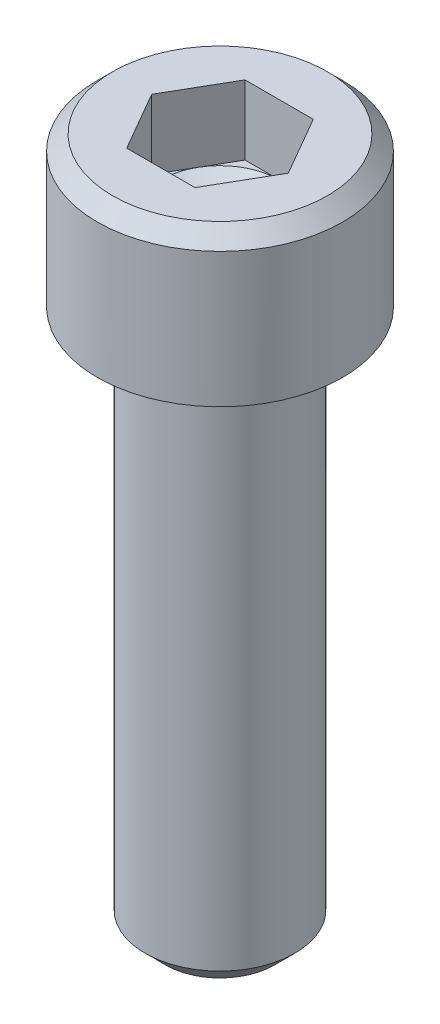
ISO-10303-21;
HEADER;
FILE_DESCRIPTION(('STEP AP214'),'2;1');
FILE_NAME('part.step','',(''),(''),'','','');
FILE_SCHEMA(('AUTOMOTIVE_DESIGN { 1 0 10303 214 1 1 1 1 }'));
ENDSEC;
DATA;
#1=APPLICATION_CONTEXT('core data for automotive mechanical design processes');
#2=APPLICATION_PROTOCOL_DEFINITION('international standard','automotive_design',2000,#1);
#3=PRODUCT_CONTEXT('',#1,'mechanical');
#4=PRODUCT('Part','Part','',(#3));
#5=PRODUCT_RELATED_PRODUCT_CATEGORY('part','',(#4));
#6=PRODUCT_DEFINITION_FORMATION('','',#4);
#7=PRODUCT_DEFINITION_CONTEXT('part definition',#1,'design');
#8=PRODUCT_DEFINITION('design','',#6,#7);
#9=PRODUCT_DEFINITION_SHAPE('','',#8);
#10=(LENGTH_UNIT() NAMED_UNIT(*) SI_UNIT(.MILLI.,.METRE.));
#11=(NAMED_UNIT(*) PLANE_ANGLE_UNIT() SI_UNIT($,.RADIAN.));
#12=(NAMED_UNIT(*) SI_UNIT($,.STERADIAN.) SOLID_ANGLE_UNIT());
#13=UNCERTAINTY_MEASURE_WITH_UNIT(LENGTH_MEASURE(1.E-05),#10,'distance_accuracy_value','');
#14=(GEOMETRIC_REPRESENTATION_CONTEXT(3) GLOBAL_UNCERTAINTY_ASSIGNED_CONTEXT((#13)) GLOBAL_UNIT_ASSIGNED_CONTEXT((#10,
#11,#12)) REPRESENTATION_CONTEXT('',''));
#15=CARTESIAN_POINT('',(0.,0.,0.));
#16=DIRECTION('',(0.,0.,1.));
#17=DIRECTION('',(1.,0.,0.));
#18=AXIS2_PLACEMENT_3D('',#15,#16,#17);
#19=CARTESIAN_POINT('',(0.,1.8796,0.));
#20=DIRECTION('',(0.,1.,0.));
#21=DIRECTION('',(0.,0.,1.));
#22=AXIS2_PLACEMENT_3D('',#19,#20,#21);
#23=PLANE('',#22);
#24=DIRECTION('',(0.5,0.,-0.866025403784439));
#25=VECTOR('',#24,1.);
#26=CARTESIAN_POINT('',(0.799225977639064,1.8796,1.38429999999992));
#27=LINE('',#26,#25);
#28=CARTESIAN_POINT('',(0.799225977639064,1.8796,1.38429999999992));
#29=VERTEX_POINT('',#28);
#30=CARTESIAN_POINT('',(1.19883896645866,1.87960000005181,0.692149999999922));
#31=VERTEX_POINT('',#30);
#32=EDGE_CURVE('E159',#29,#31,#27,.T.);
#33=ORIENTED_EDGE('',*,*,#32,.T.);
#34=CARTESIAN_POINT('',(0.,1.87960000005181,0.));
#35=DIRECTION('',(0.,-1.,0.));
#36=DIRECTION('',(1.,0.,0.));
#37=AXIS2_PLACEMENT_3D('',#34,#35,#36);
#38=CIRCLE('',#37,1.38429999998393);
#39=CARTESIAN_POINT('',(0.,1.87960000005181,1.38429999998393));
#40=VERTEX_POINT('',#39);
#41=EDGE_CURVE('E47',#31,#40,#38,.T.);
#42=ORIENTED_EDGE('',*,*,#41,.T.);
#43=DIRECTION('',(1.,0.,0.));
#44=VECTOR('',#43,1.);
#45=CARTESIAN_POINT('',(-0.799225977639255,1.8796,1.38429999999992));
#46=LINE('',#45,#44);
#47=EDGE_CURVE('E189',#40,#29,#46,.T.);
#48=ORIENTED_EDGE('',*,*,#47,.T.);
#49=EDGE_LOOP('',(#33,#42,#48));
#50=FACE_BOUND('',#49,.T.);
#51=ADVANCED_FACE('F32',(#50),#23,.T.);
#52=CARTESIAN_POINT('',(-0.799225977639255,1.8796,1.38429999999992));
#53=VERTEX_POINT('',#52);
#54=EDGE_CURVE('E279',#53,#40,#46,.T.);
#55=ORIENTED_EDGE('',*,*,#54,.T.);
#56=CARTESIAN_POINT('',(-1.19883896644491,1.87960000005181,0.692149999991913));
#57=VERTEX_POINT('',#56);
#58=EDGE_CURVE('E208',#40,#57,#38,.T.);
#59=ORIENTED_EDGE('',*,*,#58,.T.);
#60=DIRECTION('',(0.499999999999962,0.,0.866025403784461));
#61=VECTOR('',#60,1.);
#62=CARTESIAN_POINT('',(-1.59845195527835,1.8796,0.));
#63=LINE('',#62,#61);
#64=EDGE_CURVE('E168',#57,#53,#63,.T.);
#65=ORIENTED_EDGE('',*,*,#64,.T.);
#66=EDGE_LOOP('',(#55,#59,#65));
#67=FACE_BOUND('',#66,.T.);
#68=ADVANCED_FACE('F122',(#67),#23,.T.);
#69=CARTESIAN_POINT('',(-1.59845195527835,1.8796,0.));
#70=VERTEX_POINT('',#69);
#71=EDGE_CURVE('E169',#70,#57,#63,.T.);
#72=ORIENTED_EDGE('',*,*,#71,.T.);
#73=CARTESIAN_POINT('',(-1.19883896644488,1.87960000005181,-0.692149999991966));
#74=VERTEX_POINT('',#73);
#75=EDGE_CURVE('E282',#57,#74,#38,.T.);
#76=ORIENTED_EDGE('',*,*,#75,.T.);
#77=DIRECTION('',(-0.5,0.,0.866025403784439));
#78=VECTOR('',#77,1.);
#79=CARTESIAN_POINT('',(-0.799225977639255,1.8796,-1.38429999999987));
#80=LINE('',#79,#78);
#81=EDGE_CURVE('E164',#74,#70,#80,.T.);
#82=ORIENTED_EDGE('',*,*,#81,.T.);
#83=EDGE_LOOP('',(#72,#76,#82));
#84=FACE_BOUND('',#83,.T.);
#85=ADVANCED_FACE('F128',(#84),#23,.T.);
#86=CARTESIAN_POINT('',(-0.799225977639255,1.8796,-1.38429999999987));
#87=VERTEX_POINT('',#86);
#88=EDGE_CURVE('E165',#87,#74,#80,.T.);
#89=ORIENTED_EDGE('',*,*,#88,.T.);
#90=CARTESIAN_POINT('',(0.,1.87960000005181,-1.38429999998393));
#91=VERTEX_POINT('',#90);
#92=EDGE_CURVE('E285',#74,#91,#38,.T.);
#93=ORIENTED_EDGE('',*,*,#92,.T.);
#94=DIRECTION('',(-1.,0.,0.));
#95=VECTOR('',#94,1.);
#96=CARTESIAN_POINT('',(0.799225977638982,1.8796,-1.38429999999987));
#97=LINE('',#96,#95);
#98=EDGE_CURVE('E154',#91,#87,#97,.T.);
#99=ORIENTED_EDGE('',*,*,#98,.T.);
#100=EDGE_LOOP('',(#89,#93,#99));
#101=FACE_BOUND('',#100,.T.);
#102=ADVANCED_FACE('F143',(#101),#23,.T.);
#103=CARTESIAN_POINT('',(0.799225977638982,1.8796,-1.38429999999987));
#104=VERTEX_POINT('',#103);
#105=EDGE_CURVE('E157',#104,#91,#97,.T.);
#106=ORIENTED_EDGE('',*,*,#105,.T.);
#107=CARTESIAN_POINT('',(1.19883896644488,1.87960000005181,-0.692149999991966));
#108=VERTEX_POINT('',#107);
#109=EDGE_CURVE('E283',#91,#108,#38,.T.);
#110=ORIENTED_EDGE('',*,*,#109,.T.);
#111=DIRECTION('',(-0.5,0.,-0.866025403784439));
#112=VECTOR('',#111,1.);
#113=CARTESIAN_POINT('',(1.59845195527816,1.8796,0.));
#114=LINE('',#113,#112);
#115=EDGE_CURVE('E155',#108,#104,#114,.T.);
#116=ORIENTED_EDGE('',*,*,#115,.T.);
#117=EDGE_LOOP('',(#106,#110,#116));
#118=FACE_BOUND('',#117,.T.);
#119=ADVANCED_FACE('F134',(#118),#23,.T.);
#120=CARTESIAN_POINT('',(1.59845195527816,1.8796,0.));
#121=VERTEX_POINT('',#120);
#122=EDGE_CURVE('E147',#121,#108,#114,.T.);
#123=ORIENTED_EDGE('',*,*,#122,.T.);
#124=EDGE_CURVE('E148',#108,#31,#38,.T.);
#125=ORIENTED_EDGE('',*,*,#124,.T.);
#126=EDGE_CURVE('E150',#31,#121,#27,.T.);
#127=ORIENTED_EDGE('',*,*,#126,.T.);
#128=EDGE_LOOP('',(#123,#125,#127));
#129=FACE_BOUND('',#128,.T.);
#130=ADVANCED_FACE('F124',(#129),#23,.T.);
#131=CARTESIAN_POINT('',(0.,0.,0.));
#132=DIRECTION('',(0.,-1.,0.));
#133=DIRECTION('',(0.,0.,-1.));
#134=AXIS2_PLACEMENT_3D('',#131,#132,#133);
#135=PLANE('',#134);
#136=CARTESIAN_POINT('',(0.,0.,0.));
#137=DIRECTION('',(0.,-1.,0.));
#138=DIRECTION('',(0.,0.,-1.));
#139=AXIS2_PLACEMENT_3D('',#136,#137,#138);
#140=CIRCLE('',#139,2.0066);
#141=CARTESIAN_POINT('',(0.,0.,-2.0066));
#142=VERTEX_POINT('',#141);
#143=EDGE_CURVE('E11',#142,#142,#140,.F.);
#144=ORIENTED_EDGE('',*,*,#143,.T.);
#145=EDGE_LOOP('',(#144));
#146=FACE_BOUND('',#145,.T.);
#147=CARTESIAN_POINT('',(0.,0.,0.));
#148=DIRECTION('',(0.,-1.,0.));
#149=DIRECTION('',(0.,0.,-1.));
#150=AXIS2_PLACEMENT_3D('',#147,#148,#149);
#151=CIRCLE('',#150,2.8702);
#152=CARTESIAN_POINT('',(0.,0.,-2.8702));
#153=VERTEX_POINT('',#152);
#154=EDGE_CURVE('E192',#153,#153,#151,.T.);
#155=ORIENTED_EDGE('',*,*,#154,.T.);
#156=EDGE_LOOP('',(#155));
#157=FACE_BOUND('',#156,.T.);
#158=ADVANCED_FACE('F133',(#146,#157),#135,.T.);
#159=CARTESIAN_POINT('',(0.,3.5052,0.));
#160=DIRECTION('',(0.,-1.,0.));
#161=DIRECTION('',(0.,0.,-1.));
#162=AXIS2_PLACEMENT_3D('',#159,#160,#161);
#163=CYLINDRICAL_SURFACE('',#162,2.8702);
#164=CARTESIAN_POINT('',(0.,3.14959999996017,0.));
#165=DIRECTION('',(0.,1.,0.));
#166=DIRECTION('',(0.,0.,1.));
#167=AXIS2_PLACEMENT_3D('',#164,#165,#166);
#168=CIRCLE('',#167,2.8702);
#169=CARTESIAN_POINT('',(0.,3.14959999996017,2.8702));
#170=VERTEX_POINT('',#169);
#171=EDGE_CURVE('E211',#170,#170,#168,.F.);
#172=ORIENTED_EDGE('',*,*,#171,.T.);
#173=EDGE_LOOP('',(#172));
#174=FACE_BOUND('',#173,.T.);
#175=ORIENTED_EDGE('',*,*,#154,.F.);
#176=EDGE_LOOP('',(#175));
#177=FACE_BOUND('',#176,.T.);
#178=ADVANCED_FACE('F140',(#174,#177),#163,.T.);
#179=CARTESIAN_POINT('',(2.8702,3.5052,0.));
#180=DIRECTION('',(0.,1.,0.));
#181=DIRECTION('',(0.,0.,1.));
#182=AXIS2_PLACEMENT_3D('',#179,#180,#181);
#183=PLANE('',#182);
#184=CARTESIAN_POINT('',(0.,3.5052,0.));
#185=DIRECTION('',(0.,1.,0.));
#186=DIRECTION('',(0.,0.,1.));
#187=AXIS2_PLACEMENT_3D('',#184,#185,#186);
#188=CIRCLE('',#187,2.51459999996016);
#189=CARTESIAN_POINT('',(0.,3.5052,2.51459999996016));
#190=VERTEX_POINT('',#189);
#191=EDGE_CURVE('E214',#190,#190,#188,.T.);
#192=ORIENTED_EDGE('',*,*,#191,.T.);
#193=EDGE_LOOP('',(#192));
#194=FACE_BOUND('',#193,.T.);
#195=DIRECTION('',(1.,0.,0.));
#196=VECTOR('',#195,1.);
#197=CARTESIAN_POINT('',(-0.799225977639255,3.5052,1.38429999999992));
#198=LINE('',#197,#196);
#199=CARTESIAN_POINT('',(-0.799225977639255,3.5052,1.38429999999992));
#200=VERTEX_POINT('',#199);
#201=CARTESIAN_POINT('',(0.799225977639064,3.5052,1.38429999999992));
#202=VERTEX_POINT('',#201);
#203=EDGE_CURVE('E55',#200,#202,#198,.T.);
#204=ORIENTED_EDGE('',*,*,#203,.F.);
#205=DIRECTION('',(0.499999999999962,0.,0.866025403784461));
#206=VECTOR('',#205,1.);
#207=CARTESIAN_POINT('',(-1.59845195527835,3.5052,0.));
#208=LINE('',#207,#206);
#209=CARTESIAN_POINT('',(-1.59845195527835,3.5052,0.));
#210=VERTEX_POINT('',#209);
#211=EDGE_CURVE('E186',#210,#200,#208,.T.);
#212=ORIENTED_EDGE('',*,*,#211,.F.);
#213=DIRECTION('',(-0.5,0.,0.866025403784439));
#214=VECTOR('',#213,1.);
#215=CARTESIAN_POINT('',(-0.799225977639255,3.5052,-1.38429999999987));
#216=LINE('',#215,#214);
#217=CARTESIAN_POINT('',(-0.799225977639255,3.5052,-1.38429999999987));
#218=VERTEX_POINT('',#217);
#219=EDGE_CURVE('E183',#218,#210,#216,.T.);
#220=ORIENTED_EDGE('',*,*,#219,.F.);
#221=DIRECTION('',(-1.,0.,0.));
#222=VECTOR('',#221,1.);
#223=CARTESIAN_POINT('',(0.799225977638982,3.5052,-1.38429999999987));
#224=LINE('',#223,#222);
#225=CARTESIAN_POINT('',(0.799225977638982,3.5052,-1.38429999999987));
#226=VERTEX_POINT('',#225);
#227=EDGE_CURVE('E180',#226,#218,#224,.T.);
#228=ORIENTED_EDGE('',*,*,#227,.F.);
#229=DIRECTION('',(-0.5,0.,-0.866025403784439));
#230=VECTOR('',#229,1.);
#231=CARTESIAN_POINT('',(1.59845195527816,3.5052,0.));
#232=LINE('',#231,#230);
#233=CARTESIAN_POINT('',(1.59845195527816,3.5052,0.));
#234=VERTEX_POINT('',#233);
#235=EDGE_CURVE('E177',#234,#226,#232,.T.);
#236=ORIENTED_EDGE('',*,*,#235,.F.);
#237=DIRECTION('',(0.5,0.,-0.866025403784439));
#238=VECTOR('',#237,1.);
#239=CARTESIAN_POINT('',(0.799225977639064,3.5052,1.38429999999992));
#240=LINE('',#239,#238);
#241=EDGE_CURVE('E174',#202,#234,#240,.T.);
#242=ORIENTED_EDGE('',*,*,#241,.F.);
#243=EDGE_LOOP('',(#204,#212,#220,#228,#236,#242));
#244=FACE_BOUND('',#243,.T.);
#245=ADVANCED_FACE('F233',(#194,#244),#183,.T.);
#246=CARTESIAN_POINT('',(0.,-12.7,0.));
#247=DIRECTION('',(0.,1.,0.));
#248=DIRECTION('',(0.,0.,1.));
#249=AXIS2_PLACEMENT_3D('',#246,#247,#248);
#250=CYLINDRICAL_SURFACE('',#249,1.7526);
#251=CARTESIAN_POINT('',(0.,-0.254000000000001,0.));
#252=DIRECTION('',(0.,-1.,0.));
#253=DIRECTION('',(0.,0.,-1.));
#254=AXIS2_PLACEMENT_3D('',#251,#252,#253);
#255=CIRCLE('',#254,1.7526);
#256=CARTESIAN_POINT('',(0.,-0.254000000000001,-1.7526));
#257=VERTEX_POINT('',#256);
#258=EDGE_CURVE('E40',#257,#257,#255,.T.);
#259=ORIENTED_EDGE('',*,*,#258,.T.);
#260=EDGE_LOOP('',(#259));
#261=FACE_BOUND('',#260,.T.);
#262=CARTESIAN_POINT('',(0.,-12.2275599999848,0.));
#263=DIRECTION('',(0.,-1.,0.));
#264=DIRECTION('',(0.,0.,-1.));
#265=AXIS2_PLACEMENT_3D('',#262,#263,#264);
#266=CIRCLE('',#265,1.7526);
#267=CARTESIAN_POINT('',(0.,-12.2275599999848,-1.7526));
#268=VERTEX_POINT('',#267);
#269=EDGE_CURVE('E207',#268,#268,#266,.F.);
#270=ORIENTED_EDGE('',*,*,#269,.T.);
#271=EDGE_LOOP('',(#270));
#272=FACE_BOUND('',#271,.T.);
#273=ADVANCED_FACE('F219',(#261,#272),#250,.T.);
#274=CARTESIAN_POINT('',(0.,-12.7,0.));
#275=DIRECTION('',(0.,-1.,0.));
#276=DIRECTION('',(0.,0.,-1.));
#277=AXIS2_PLACEMENT_3D('',#274,#275,#276);
#278=PLANE('',#277);
#279=CARTESIAN_POINT('',(0.,-12.7,0.));
#280=DIRECTION('',(0.,-1.,0.));
#281=DIRECTION('',(0.,0.,-1.));
#282=AXIS2_PLACEMENT_3D('',#279,#280,#281);
#283=CIRCLE('',#282,1.28015999998476);
#284=CARTESIAN_POINT('',(0.,-12.7,-1.28015999998476));
#285=VERTEX_POINT('',#284);
#286=EDGE_CURVE('E204',#285,#285,#283,.T.);
#287=ORIENTED_EDGE('',*,*,#286,.T.);
#288=EDGE_LOOP('',(#287));
#289=FACE_BOUND('',#288,.T.);
#290=ADVANCED_FACE('F244',(#289),#278,.T.);
#291=CARTESIAN_POINT('',(-0.799225977639255,1.8796,1.38429999999992));
#292=DIRECTION('',(0.,0.,1.));
#293=DIRECTION('',(1.,0.,0.));
#294=AXIS2_PLACEMENT_3D('',#291,#292,#293);
#295=PLANE('',#294);
#296=ORIENTED_EDGE('',*,*,#203,.T.);
#297=DIRECTION('',(0.,1.,0.));
#298=VECTOR('',#297,1.);
#299=CARTESIAN_POINT('',(0.799225977639064,1.8796,1.38429999999992));
#300=LINE('',#299,#298);
#301=EDGE_CURVE('E172',#29,#202,#300,.T.);
#302=ORIENTED_EDGE('',*,*,#301,.F.);
#303=ORIENTED_EDGE('',*,*,#47,.F.);
#304=ORIENTED_EDGE('',*,*,#54,.F.);
#305=DIRECTION('',(0.,1.,0.));
#306=VECTOR('',#305,1.);
#307=CARTESIAN_POINT('',(-0.799225977639255,1.8796,1.38429999999992));
#308=LINE('',#307,#306);
#309=EDGE_CURVE('E190',#53,#200,#308,.T.);
#310=ORIENTED_EDGE('',*,*,#309,.T.);
#311=EDGE_LOOP('',(#296,#302,#303,#304,#310));
#312=FACE_BOUND('',#311,.T.);
#313=ADVANCED_FACE('F247',(#312),#295,.F.);
#314=CARTESIAN_POINT('',(-1.59845195527835,1.8796,0.));
#315=DIRECTION('',(-0.866025403784461,0.,0.499999999999962));
#316=DIRECTION('',(0.499999999999962,0.,0.866025403784461));
#317=AXIS2_PLACEMENT_3D('',#314,#315,#316);
#318=PLANE('',#317);
#319=ORIENTED_EDGE('',*,*,#211,.T.);
#320=ORIENTED_EDGE('',*,*,#309,.F.);
#321=ORIENTED_EDGE('',*,*,#64,.F.);
#322=ORIENTED_EDGE('',*,*,#71,.F.);
#323=DIRECTION('',(0.,1.,0.));
#324=VECTOR('',#323,1.);
#325=CARTESIAN_POINT('',(-1.59845195527835,1.8796,0.));
#326=LINE('',#325,#324);
#327=EDGE_CURVE('E193',#70,#210,#326,.T.);
#328=ORIENTED_EDGE('',*,*,#327,.T.);
#329=EDGE_LOOP('',(#319,#320,#321,#322,#328));
#330=FACE_BOUND('',#329,.T.);
#331=ADVANCED_FACE('F250',(#330),#318,.F.);
#332=CARTESIAN_POINT('',(-0.799225977639255,1.8796,-1.38429999999987));
#333=DIRECTION('',(-0.866025403784439,0.,-0.5));
#334=DIRECTION('',(-0.5,0.,0.866025403784439));
#335=AXIS2_PLACEMENT_3D('',#332,#333,#334);
#336=PLANE('',#335);
#337=ORIENTED_EDGE('',*,*,#219,.T.);
#338=ORIENTED_EDGE('',*,*,#327,.F.);
#339=ORIENTED_EDGE('',*,*,#81,.F.);
#340=ORIENTED_EDGE('',*,*,#88,.F.);
#341=DIRECTION('',(0.,1.,0.));
#342=VECTOR('',#341,1.);
#343=CARTESIAN_POINT('',(-0.799225977639255,1.8796,-1.38429999999987));
#344=LINE('',#343,#342);
#345=EDGE_CURVE('E195',#87,#218,#344,.T.);
#346=ORIENTED_EDGE('',*,*,#345,.T.);
#347=EDGE_LOOP('',(#337,#338,#339,#340,#346));
#348=FACE_BOUND('',#347,.T.);
#349=ADVANCED_FACE('F257',(#348),#336,.F.);
#350=CARTESIAN_POINT('',(0.799225977638982,1.8796,-1.38429999999987));
#351=DIRECTION('',(0.,0.,-1.));
#352=DIRECTION('',(-1.,0.,0.));
#353=AXIS2_PLACEMENT_3D('',#350,#351,#352);
#354=PLANE('',#353);
#355=ORIENTED_EDGE('',*,*,#227,.T.);
#356=ORIENTED_EDGE('',*,*,#345,.F.);
#357=ORIENTED_EDGE('',*,*,#98,.F.);
#358=ORIENTED_EDGE('',*,*,#105,.F.);
#359=DIRECTION('',(0.,1.,0.));
#360=VECTOR('',#359,1.);
#361=CARTESIAN_POINT('',(0.799225977638982,1.8796,-1.38429999999987));
#362=LINE('',#361,#360);
#363=EDGE_CURVE('E197',#104,#226,#362,.T.);
#364=ORIENTED_EDGE('',*,*,#363,.T.);
#365=EDGE_LOOP('',(#355,#356,#357,#358,#364));
#366=FACE_BOUND('',#365,.T.);
#367=ADVANCED_FACE('F254',(#366),#354,.F.);
#368=CARTESIAN_POINT('',(1.59845195527816,1.8796,0.));
#369=DIRECTION('',(0.866025403784439,0.,-0.5));
#370=DIRECTION('',(-0.5,0.,-0.866025403784439));
#371=AXIS2_PLACEMENT_3D('',#368,#369,#370);
#372=PLANE('',#371);
#373=ORIENTED_EDGE('',*,*,#235,.T.);
#374=ORIENTED_EDGE('',*,*,#363,.F.);
#375=ORIENTED_EDGE('',*,*,#115,.F.);
#376=ORIENTED_EDGE('',*,*,#122,.F.);
#377=DIRECTION('',(0.,1.,0.));
#378=VECTOR('',#377,1.);
#379=CARTESIAN_POINT('',(1.59845195527816,1.8796,0.));
#380=LINE('',#379,#378);
#381=EDGE_CURVE('E199',#121,#234,#380,.T.);
#382=ORIENTED_EDGE('',*,*,#381,.T.);
#383=EDGE_LOOP('',(#373,#374,#375,#376,#382));
#384=FACE_BOUND('',#383,.T.);
#385=ADVANCED_FACE('F117',(#384),#372,.F.);
#386=CARTESIAN_POINT('',(0.799225977639064,1.8796,1.38429999999992));
#387=DIRECTION('',(0.866025403784439,0.,0.5));
#388=DIRECTION('',(0.5,0.,-0.866025403784439));
#389=AXIS2_PLACEMENT_3D('',#386,#387,#388);
#390=PLANE('',#389);
#391=ORIENTED_EDGE('',*,*,#241,.T.);
#392=ORIENTED_EDGE('',*,*,#381,.F.);
#393=ORIENTED_EDGE('',*,*,#126,.F.);
#394=ORIENTED_EDGE('',*,*,#32,.F.);
#395=ORIENTED_EDGE('',*,*,#301,.T.);
#396=EDGE_LOOP('',(#391,#392,#393,#394,#395));
#397=FACE_BOUND('',#396,.T.);
#398=ADVANCED_FACE('F108',(#397),#390,.F.);
#399=CARTESIAN_POINT('',(0.,1.08037402242189,0.));
#400=DIRECTION('',(0.,1.,0.));
#401=DIRECTION('',(-1.,0.,0.));
#402=AXIS2_PLACEMENT_3D('',#399,#400,#401);
#403=CONICAL_SURFACE('',#402,0.,1.0471975511966);
#404=ORIENTED_EDGE('',*,*,#41,.F.);
#405=ORIENTED_EDGE('',*,*,#124,.F.);
#406=ORIENTED_EDGE('',*,*,#109,.F.);
#407=ORIENTED_EDGE('',*,*,#92,.F.);
#408=ORIENTED_EDGE('',*,*,#75,.F.);
#409=ORIENTED_EDGE('',*,*,#58,.F.);
#410=EDGE_LOOP('',(#404,#405,#406,#407,#408,#409));
#411=FACE_BOUND('',#410,.T.);
#412=CARTESIAN_POINT('',(0.,1.08037402242189,0.));
#413=VERTEX_POINT('',#412);
#414=VERTEX_LOOP('',#413);
#415=FACE_BOUND('',#414,.T.);
#416=ADVANCED_FACE('F105',(#411,#415),#403,.F.);
#417=CARTESIAN_POINT('',(0.,-12.7,0.));
#418=DIRECTION('',(0.,1.,0.));
#419=DIRECTION('',(0.,0.,1.));
#420=AXIS2_PLACEMENT_3D('',#417,#418,#419);
#421=CONICAL_SURFACE('',#420,1.28015999998476,0.785398163397447);
#422=ORIENTED_EDGE('',*,*,#269,.F.);
#423=EDGE_LOOP('',(#422));
#424=FACE_BOUND('',#423,.T.);
#425=ORIENTED_EDGE('',*,*,#286,.F.);
#426=EDGE_LOOP('',(#425));
#427=FACE_BOUND('',#426,.T.);
#428=ADVANCED_FACE('F107',(#424,#427),#421,.T.);
#429=CARTESIAN_POINT('',(0.,3.14959999996017,0.));
#430=DIRECTION('',(0.,-1.,0.));
#431=DIRECTION('',(0.,0.,-1.));
#432=AXIS2_PLACEMENT_3D('',#429,#430,#431);
#433=CONICAL_SURFACE('',#432,2.8702,0.785398163397451);
#434=ORIENTED_EDGE('',*,*,#191,.F.);
#435=EDGE_LOOP('',(#434));
#436=FACE_BOUND('',#435,.T.);
#437=ORIENTED_EDGE('',*,*,#171,.F.);
#438=EDGE_LOOP('',(#437));
#439=FACE_BOUND('',#438,.T.);
#440=ADVANCED_FACE('F114',(#436,#439),#433,.T.);
#441=CARTESIAN_POINT('',(0.,-0.254000000000001,0.));
#442=DIRECTION('',(0.,-1.,0.));
#443=DIRECTION('',(0.,0.,-1.));
#444=AXIS2_PLACEMENT_3D('',#441,#442,#443);
#445=TOROIDAL_SURFACE('',#444,2.0066,0.254);
#446=ORIENTED_EDGE('',*,*,#143,.F.);
#447=EDGE_LOOP('',(#446));
#448=FACE_BOUND('',#447,.T.);
#449=ORIENTED_EDGE('',*,*,#258,.F.);
#450=EDGE_LOOP('',(#449));
#451=FACE_BOUND('',#450,.T.);
#452=ADVANCED_FACE('F34',(#448,#451),#445,.F.);
#453=CLOSED_SHELL('',(#51,#68,#85,#102,#119,#130,#158,#178,#245,#273,#290,#313,#331,#349,#367,
#385,#398,#416,#428,#440,#452));
#454=MANIFOLD_SOLID_BREP('B2',#453);
#455=ADVANCED_BREP_SHAPE_REPRESENTATION('',(#18,#454),#14);
#456=SHAPE_DEFINITION_REPRESENTATION(#9,#455);
ENDSEC;
END-ISO-10303-21;
